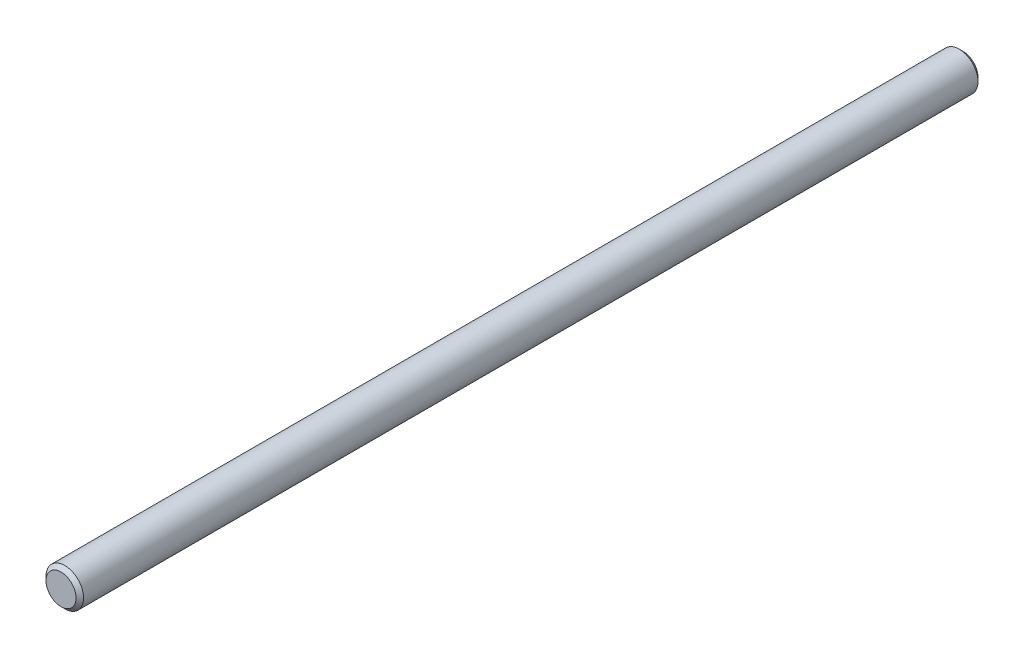
ISO-10303-21;
HEADER;
FILE_DESCRIPTION(('STEP AP214'),'2;1');
FILE_NAME('part.step','',(''),(''),'','','');
FILE_SCHEMA(('AUTOMOTIVE_DESIGN { 1 0 10303 214 1 1 1 1 }'));
ENDSEC;
DATA;
#1=APPLICATION_CONTEXT('core data for automotive mechanical design processes');
#2=APPLICATION_PROTOCOL_DEFINITION('international standard','automotive_design',2000,#1);
#3=PRODUCT_CONTEXT('',#1,'mechanical');
#4=PRODUCT('Part','Part','',(#3));
#5=PRODUCT_RELATED_PRODUCT_CATEGORY('part','',(#4));
#6=PRODUCT_DEFINITION_FORMATION('','',#4);
#7=PRODUCT_DEFINITION_CONTEXT('part definition',#1,'design');
#8=PRODUCT_DEFINITION('design','',#6,#7);
#9=PRODUCT_DEFINITION_SHAPE('','',#8);
#10=(LENGTH_UNIT() NAMED_UNIT(*) SI_UNIT(.MILLI.,.METRE.));
#11=(NAMED_UNIT(*) PLANE_ANGLE_UNIT() SI_UNIT($,.RADIAN.));
#12=(NAMED_UNIT(*) SI_UNIT($,.STERADIAN.) SOLID_ANGLE_UNIT());
#13=UNCERTAINTY_MEASURE_WITH_UNIT(LENGTH_MEASURE(1.E-05),#10,'distance_accuracy_value','');
#14=(GEOMETRIC_REPRESENTATION_CONTEXT(3) GLOBAL_UNCERTAINTY_ASSIGNED_CONTEXT((#13)) GLOBAL_UNIT_ASSIGNED_CONTEXT((#10,
#11,#12)) REPRESENTATION_CONTEXT('',''));
#15=CARTESIAN_POINT('',(0.,0.,0.));
#16=DIRECTION('',(0.,0.,1.));
#17=DIRECTION('',(1.,0.,0.));
#18=AXIS2_PLACEMENT_3D('',#15,#16,#17);
#19=CARTESIAN_POINT('',(0.,0.,76.2));
#20=DIRECTION('',(0.,0.,-1.));
#21=DIRECTION('',(-1.,0.,0.));
#22=AXIS2_PLACEMENT_3D('',#19,#20,#21);
#23=CYLINDRICAL_SURFACE('',#22,3.175);
#24=CARTESIAN_POINT('',(0.,0.,-75.5649999999999));
#25=DIRECTION('',(0.,0.,1.));
#26=DIRECTION('',(1.,0.,0.));
#27=AXIS2_PLACEMENT_3D('',#24,#25,#26);
#28=CIRCLE('',#27,3.175);
#29=CARTESIAN_POINT('',(3.175,0.,-75.5649999999999));
#30=VERTEX_POINT('',#29);
#31=EDGE_CURVE('E40',#30,#30,#28,.T.);
#32=ORIENTED_EDGE('',*,*,#31,.T.);
#33=EDGE_LOOP('',(#32));
#34=FACE_BOUND('',#33,.T.);
#35=CARTESIAN_POINT('',(0.,0.,75.5650000000001));
#36=DIRECTION('',(0.,0.,1.));
#37=DIRECTION('',(1.,0.,0.));
#38=AXIS2_PLACEMENT_3D('',#35,#36,#37);
#39=CIRCLE('',#38,3.175);
#40=CARTESIAN_POINT('',(3.175,0.,75.5650000000001));
#41=VERTEX_POINT('',#40);
#42=EDGE_CURVE('E44',#41,#41,#39,.F.);
#43=ORIENTED_EDGE('',*,*,#42,.T.);
#44=EDGE_LOOP('',(#43));
#45=FACE_BOUND('',#44,.T.);
#46=ADVANCED_FACE('F29',(#34,#45),#23,.T.);
#47=CARTESIAN_POINT('',(0.,0.,76.2));
#48=DIRECTION('',(0.,0.,1.));
#49=DIRECTION('',(1.,0.,0.));
#50=AXIS2_PLACEMENT_3D('',#47,#48,#49);
#51=PLANE('',#50);
#52=CARTESIAN_POINT('',(0.,0.,76.2));
#53=DIRECTION('',(0.,0.,1.));
#54=DIRECTION('',(1.,0.,0.));
#55=AXIS2_PLACEMENT_3D('',#52,#53,#54);
#56=CIRCLE('',#55,2.54000000000008);
#57=CARTESIAN_POINT('',(2.54000000000008,0.,76.2));
#58=VERTEX_POINT('',#57);
#59=EDGE_CURVE('E10',#58,#58,#56,.T.);
#60=ORIENTED_EDGE('',*,*,#59,.T.);
#61=EDGE_LOOP('',(#60));
#62=FACE_BOUND('',#61,.T.);
#63=ADVANCED_FACE('F60',(#62),#51,.T.);
#64=CARTESIAN_POINT('',(0.,0.,-76.2));
#65=DIRECTION('',(0.,0.,1.));
#66=DIRECTION('',(1.,0.,0.));
#67=AXIS2_PLACEMENT_3D('',#64,#65,#66);
#68=PLANE('',#67);
#69=CARTESIAN_POINT('',(0.,0.,-76.2));
#70=DIRECTION('',(0.,0.,1.));
#71=DIRECTION('',(1.,0.,0.));
#72=AXIS2_PLACEMENT_3D('',#69,#70,#71);
#73=CIRCLE('',#72,2.53999999999988);
#74=CARTESIAN_POINT('',(2.53999999999988,0.,-76.2));
#75=VERTEX_POINT('',#74);
#76=EDGE_CURVE('E36',#75,#75,#73,.F.);
#77=ORIENTED_EDGE('',*,*,#76,.T.);
#78=EDGE_LOOP('',(#77));
#79=FACE_BOUND('',#78,.T.);
#80=ADVANCED_FACE('F57',(#79),#68,.F.);
#81=CARTESIAN_POINT('',(0.,0.,-75.5649999999999));
#82=DIRECTION('',(0.,0.,1.));
#83=DIRECTION('',(1.,0.,0.));
#84=AXIS2_PLACEMENT_3D('',#81,#82,#83);
#85=CONICAL_SURFACE('',#84,3.175,0.78539816339744);
#86=ORIENTED_EDGE('',*,*,#76,.F.);
#87=EDGE_LOOP('',(#86));
#88=FACE_BOUND('',#87,.T.);
#89=ORIENTED_EDGE('',*,*,#31,.F.);
#90=EDGE_LOOP('',(#89));
#91=FACE_BOUND('',#90,.T.);
#92=ADVANCED_FACE('F53',(#88,#91),#85,.T.);
#93=CARTESIAN_POINT('',(0.,0.,76.2));
#94=DIRECTION('',(0.,0.,-1.));
#95=DIRECTION('',(-1.,0.,0.));
#96=AXIS2_PLACEMENT_3D('',#93,#94,#95);
#97=CONICAL_SURFACE('',#96,2.54000000000008,0.785398163397451);
#98=ORIENTED_EDGE('',*,*,#42,.F.);
#99=EDGE_LOOP('',(#98));
#100=FACE_BOUND('',#99,.T.);
#101=ORIENTED_EDGE('',*,*,#59,.F.);
#102=EDGE_LOOP('',(#101));
#103=FACE_BOUND('',#102,.T.);
#104=ADVANCED_FACE('F31',(#100,#103),#97,.T.);
#105=CLOSED_SHELL('',(#46,#63,#80,#92,#104));
#106=MANIFOLD_SOLID_BREP('B2',#105);
#107=ADVANCED_BREP_SHAPE_REPRESENTATION('',(#18,#106),#14);
#108=SHAPE_DEFINITION_REPRESENTATION(#9,#107);
ENDSEC;
END-ISO-10303-21;
